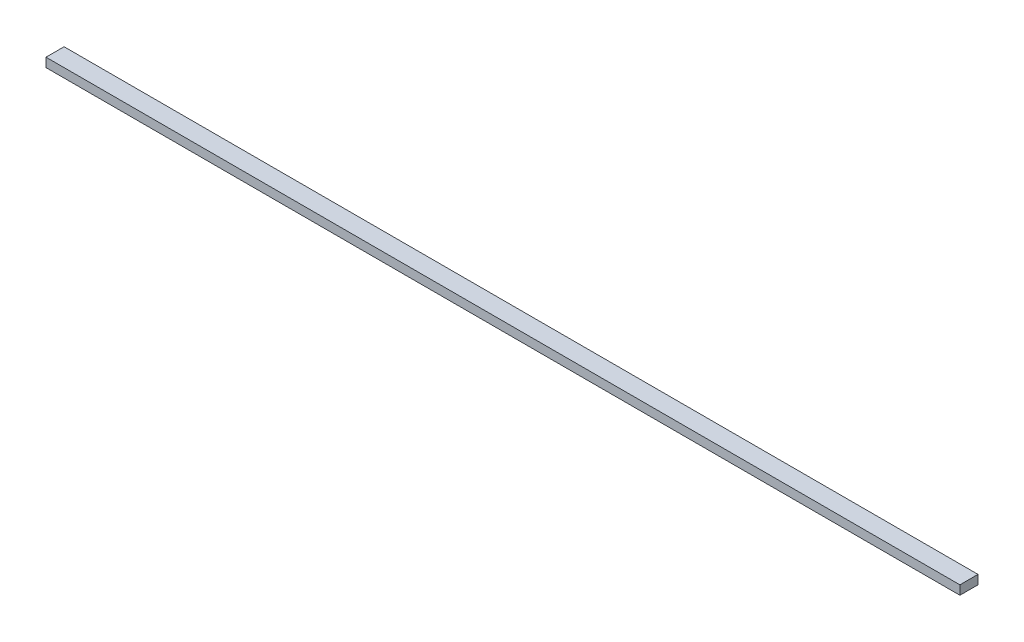
ISO-10303-21;
HEADER;
FILE_DESCRIPTION(('STEP AP214'),'2;1');
FILE_NAME('part.step','',(''),(''),'','','');
FILE_SCHEMA(('AUTOMOTIVE_DESIGN { 1 0 10303 214 1 1 1 1 }'));
ENDSEC;
DATA;
#1=APPLICATION_CONTEXT('core data for automotive mechanical design processes');
#2=APPLICATION_PROTOCOL_DEFINITION('international standard','automotive_design',2000,#1);
#3=PRODUCT_CONTEXT('',#1,'mechanical');
#4=PRODUCT('Part','Part','',(#3));
#5=PRODUCT_RELATED_PRODUCT_CATEGORY('part','',(#4));
#6=PRODUCT_DEFINITION_FORMATION('','',#4);
#7=PRODUCT_DEFINITION_CONTEXT('part definition',#1,'design');
#8=PRODUCT_DEFINITION('design','',#6,#7);
#9=PRODUCT_DEFINITION_SHAPE('','',#8);
#10=(LENGTH_UNIT() NAMED_UNIT(*) SI_UNIT(.MILLI.,.METRE.));
#11=(NAMED_UNIT(*) PLANE_ANGLE_UNIT() SI_UNIT($,.RADIAN.));
#12=(NAMED_UNIT(*) SI_UNIT($,.STERADIAN.) SOLID_ANGLE_UNIT());
#13=UNCERTAINTY_MEASURE_WITH_UNIT(LENGTH_MEASURE(1.E-05),#10,'distance_accuracy_value','');
#14=(GEOMETRIC_REPRESENTATION_CONTEXT(3) GLOBAL_UNCERTAINTY_ASSIGNED_CONTEXT((#13)) GLOBAL_UNIT_ASSIGNED_CONTEXT((#10,
#11,#12)) REPRESENTATION_CONTEXT('',''));
#15=CARTESIAN_POINT('',(0.,0.,0.));
#16=DIRECTION('',(0.,0.,1.));
#17=DIRECTION('',(1.,0.,0.));
#18=AXIS2_PLACEMENT_3D('',#15,#16,#17);
#19=CARTESIAN_POINT('',(-505.,10.,-9.99999999999993));
#20=DIRECTION('',(1.,0.,0.));
#21=DIRECTION('',(0.,0.,-1.));
#22=AXIS2_PLACEMENT_3D('',#19,#20,#21);
#23=PLANE('',#22);
#24=DIRECTION('',(0.,0.,1.));
#25=VECTOR('',#24,1.);
#26=CARTESIAN_POINT('',(-505.,0.,-9.99999999999993));
#27=LINE('',#26,#25);
#28=CARTESIAN_POINT('',(-505.,0.,-9.99999999999993));
#29=VERTEX_POINT('',#28);
#30=CARTESIAN_POINT('',(-505.,0.,10.0000000000001));
#31=VERTEX_POINT('',#30);
#32=EDGE_CURVE('E95',#29,#31,#27,.T.);
#33=ORIENTED_EDGE('',*,*,#32,.T.);
#34=DIRECTION('',(0.,-1.,0.));
#35=VECTOR('',#34,1.);
#36=CARTESIAN_POINT('',(-505.,10.,10.0000000000001));
#37=LINE('',#36,#35);
#38=CARTESIAN_POINT('',(-505.,10.,10.0000000000001));
#39=VERTEX_POINT('',#38);
#40=EDGE_CURVE('E11',#39,#31,#37,.T.);
#41=ORIENTED_EDGE('',*,*,#40,.F.);
#42=DIRECTION('',(0.,0.,1.));
#43=VECTOR('',#42,1.);
#44=CARTESIAN_POINT('',(-505.,10.,-9.99999999999993));
#45=LINE('',#44,#43);
#46=CARTESIAN_POINT('',(-505.,10.,-9.99999999999993));
#47=VERTEX_POINT('',#46);
#48=EDGE_CURVE('E83',#47,#39,#45,.T.);
#49=ORIENTED_EDGE('',*,*,#48,.F.);
#50=DIRECTION('',(0.,-1.,0.));
#51=VECTOR('',#50,1.);
#52=CARTESIAN_POINT('',(-505.,10.,-9.99999999999993));
#53=LINE('',#52,#51);
#54=EDGE_CURVE('E91',#47,#29,#53,.T.);
#55=ORIENTED_EDGE('',*,*,#54,.T.);
#56=EDGE_LOOP('',(#33,#41,#49,#55));
#57=FACE_BOUND('',#56,.T.);
#58=ADVANCED_FACE('F32',(#57),#23,.F.);
#59=CARTESIAN_POINT('',(-505.,10.,10.0000000000001));
#60=DIRECTION('',(0.,0.,-1.));
#61=DIRECTION('',(-1.,0.,0.));
#62=AXIS2_PLACEMENT_3D('',#59,#60,#61);
#63=PLANE('',#62);
#64=DIRECTION('',(1.,0.,0.));
#65=VECTOR('',#64,1.);
#66=CARTESIAN_POINT('',(-505.,0.,10.0000000000001));
#67=LINE('',#66,#65);
#68=CARTESIAN_POINT('',(505.,0.,10.0000000000001));
#69=VERTEX_POINT('',#68);
#70=EDGE_CURVE('E87',#31,#69,#67,.T.);
#71=ORIENTED_EDGE('',*,*,#70,.T.);
#72=DIRECTION('',(0.,-1.,0.));
#73=VECTOR('',#72,1.);
#74=CARTESIAN_POINT('',(505.,10.,10.0000000000001));
#75=LINE('',#74,#73);
#76=CARTESIAN_POINT('',(505.,10.,10.0000000000001));
#77=VERTEX_POINT('',#76);
#78=EDGE_CURVE('E40',#77,#69,#75,.T.);
#79=ORIENTED_EDGE('',*,*,#78,.F.);
#80=DIRECTION('',(1.,0.,0.));
#81=VECTOR('',#80,1.);
#82=CARTESIAN_POINT('',(-505.,10.,10.0000000000001));
#83=LINE('',#82,#81);
#84=EDGE_CURVE('E78',#39,#77,#83,.T.);
#85=ORIENTED_EDGE('',*,*,#84,.F.);
#86=ORIENTED_EDGE('',*,*,#40,.T.);
#87=EDGE_LOOP('',(#71,#79,#85,#86));
#88=FACE_BOUND('',#87,.T.);
#89=ADVANCED_FACE('F86',(#88),#63,.F.);
#90=CARTESIAN_POINT('',(505.,10.,-9.99999999999993));
#91=DIRECTION('',(-1.,0.,0.));
#92=DIRECTION('',(0.,0.,1.));
#93=AXIS2_PLACEMENT_3D('',#90,#91,#92);
#94=PLANE('',#93);
#95=DIRECTION('',(0.,0.,-1.));
#96=VECTOR('',#95,1.);
#97=CARTESIAN_POINT('',(505.,0.,-9.99999999999993));
#98=LINE('',#97,#96);
#99=CARTESIAN_POINT('',(505.,0.,-9.99999999999993));
#100=VERTEX_POINT('',#99);
#101=EDGE_CURVE('E65',#69,#100,#98,.T.);
#102=ORIENTED_EDGE('',*,*,#101,.T.);
#103=DIRECTION('',(0.,-1.,0.));
#104=VECTOR('',#103,1.);
#105=CARTESIAN_POINT('',(505.,10.,-9.99999999999993));
#106=LINE('',#105,#104);
#107=CARTESIAN_POINT('',(505.,10.,-9.99999999999993));
#108=VERTEX_POINT('',#107);
#109=EDGE_CURVE('E88',#108,#100,#106,.T.);
#110=ORIENTED_EDGE('',*,*,#109,.F.);
#111=DIRECTION('',(0.,0.,-1.));
#112=VECTOR('',#111,1.);
#113=CARTESIAN_POINT('',(505.,10.,-9.99999999999993));
#114=LINE('',#113,#112);
#115=EDGE_CURVE('E81',#77,#108,#114,.T.);
#116=ORIENTED_EDGE('',*,*,#115,.F.);
#117=ORIENTED_EDGE('',*,*,#78,.T.);
#118=EDGE_LOOP('',(#102,#110,#116,#117));
#119=FACE_BOUND('',#118,.T.);
#120=ADVANCED_FACE('F89',(#119),#94,.F.);
#121=CARTESIAN_POINT('',(-505.,10.,-9.99999999999993));
#122=DIRECTION('',(0.,0.,1.));
#123=DIRECTION('',(1.,0.,0.));
#124=AXIS2_PLACEMENT_3D('',#121,#122,#123);
#125=PLANE('',#124);
#126=DIRECTION('',(-1.,0.,0.));
#127=VECTOR('',#126,1.);
#128=CARTESIAN_POINT('',(-505.,0.,-9.99999999999993));
#129=LINE('',#128,#127);
#130=EDGE_CURVE('E71',#100,#29,#129,.T.);
#131=ORIENTED_EDGE('',*,*,#130,.T.);
#132=ORIENTED_EDGE('',*,*,#54,.F.);
#133=DIRECTION('',(-1.,0.,0.));
#134=VECTOR('',#133,1.);
#135=CARTESIAN_POINT('',(-505.,10.,-9.99999999999993));
#136=LINE('',#135,#134);
#137=EDGE_CURVE('E48',#108,#47,#136,.T.);
#138=ORIENTED_EDGE('',*,*,#137,.F.);
#139=ORIENTED_EDGE('',*,*,#109,.T.);
#140=EDGE_LOOP('',(#131,#132,#138,#139));
#141=FACE_BOUND('',#140,.T.);
#142=ADVANCED_FACE('F102',(#141),#125,.F.);
#143=CARTESIAN_POINT('',(0.,10.,0.));
#144=DIRECTION('',(0.,1.,0.));
#145=DIRECTION('',(0.,0.,1.));
#146=AXIS2_PLACEMENT_3D('',#143,#144,#145);
#147=PLANE('',#146);
#148=ORIENTED_EDGE('',*,*,#48,.T.);
#149=ORIENTED_EDGE('',*,*,#84,.T.);
#150=ORIENTED_EDGE('',*,*,#115,.T.);
#151=ORIENTED_EDGE('',*,*,#137,.T.);
#152=EDGE_LOOP('',(#148,#149,#150,#151));
#153=FACE_BOUND('',#152,.T.);
#154=ADVANCED_FACE('F79',(#153),#147,.T.);
#155=CARTESIAN_POINT('',(0.,0.,0.));
#156=DIRECTION('',(0.,1.,0.));
#157=DIRECTION('',(0.,0.,1.));
#158=AXIS2_PLACEMENT_3D('',#155,#156,#157);
#159=PLANE('',#158);
#160=ORIENTED_EDGE('',*,*,#32,.F.);
#161=ORIENTED_EDGE('',*,*,#130,.F.);
#162=ORIENTED_EDGE('',*,*,#101,.F.);
#163=ORIENTED_EDGE('',*,*,#70,.F.);
#164=EDGE_LOOP('',(#160,#161,#162,#163));
#165=FACE_BOUND('',#164,.T.);
#166=ADVANCED_FACE('F105',(#165),#159,.F.);
#167=CLOSED_SHELL('',(#58,#89,#120,#142,#154,#166));
#168=MANIFOLD_SOLID_BREP('B2',#167);
#169=ADVANCED_BREP_SHAPE_REPRESENTATION('',(#18,#168),#14);
#170=SHAPE_DEFINITION_REPRESENTATION(#9,#169);
ENDSEC;
END-ISO-10303-21;
